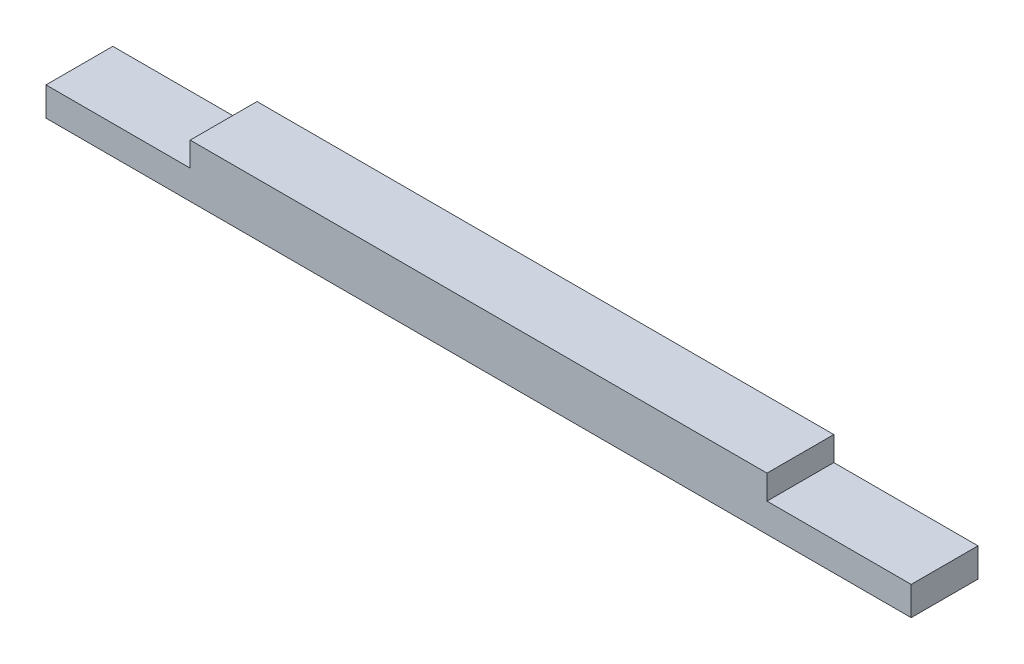
ISO-10303-21;
HEADER;
FILE_DESCRIPTION(('STEP AP214'),'2;1');
FILE_NAME('part.step','',(''),(''),'','','');
FILE_SCHEMA(('AUTOMOTIVE_DESIGN { 1 0 10303 214 1 1 1 1 }'));
ENDSEC;
DATA;
#1=APPLICATION_CONTEXT('core data for automotive mechanical design processes');
#2=APPLICATION_PROTOCOL_DEFINITION('international standard','automotive_design',2000,#1);
#3=PRODUCT_CONTEXT('',#1,'mechanical');
#4=PRODUCT('Part','Part','',(#3));
#5=PRODUCT_RELATED_PRODUCT_CATEGORY('part','',(#4));
#6=PRODUCT_DEFINITION_FORMATION('','',#4);
#7=PRODUCT_DEFINITION_CONTEXT('part definition',#1,'design');
#8=PRODUCT_DEFINITION('design','',#6,#7);
#9=PRODUCT_DEFINITION_SHAPE('','',#8);
#10=(LENGTH_UNIT() NAMED_UNIT(*) SI_UNIT(.MILLI.,.METRE.));
#11=(NAMED_UNIT(*) PLANE_ANGLE_UNIT() SI_UNIT($,.RADIAN.));
#12=(NAMED_UNIT(*) SI_UNIT($,.STERADIAN.) SOLID_ANGLE_UNIT());
#13=UNCERTAINTY_MEASURE_WITH_UNIT(LENGTH_MEASURE(1.E-05),#10,'distance_accuracy_value','');
#14=(GEOMETRIC_REPRESENTATION_CONTEXT(3) GLOBAL_UNCERTAINTY_ASSIGNED_CONTEXT((#13)) GLOBAL_UNIT_ASSIGNED_CONTEXT((#10,
#11,#12)) REPRESENTATION_CONTEXT('',''));
#15=CARTESIAN_POINT('',(0.,0.,0.));
#16=DIRECTION('',(0.,0.,1.));
#17=DIRECTION('',(1.,0.,0.));
#18=AXIS2_PLACEMENT_3D('',#15,#16,#17);
#19=CARTESIAN_POINT('',(7.5,3.,6.95));
#20=DIRECTION('',(-1.,0.,0.));
#21=DIRECTION('',(0.,-1.,0.));
#22=AXIS2_PLACEMENT_3D('',#19,#20,#21);
#23=PLANE('',#22);
#24=DIRECTION('',(0.,1.,0.));
#25=VECTOR('',#24,1.);
#26=CARTESIAN_POINT('',(7.5,3.,0.));
#27=LINE('',#26,#25);
#28=CARTESIAN_POINT('',(7.5,3.,0.));
#29=VERTEX_POINT('',#28);
#30=CARTESIAN_POINT('',(7.49999999999999,5.525,0.));
#31=VERTEX_POINT('',#30);
#32=EDGE_CURVE('E130',#29,#31,#27,.T.);
#33=ORIENTED_EDGE('',*,*,#32,.F.);
#34=DIRECTION('',(0.,0.,-1.));
#35=VECTOR('',#34,1.);
#36=CARTESIAN_POINT('',(7.5,3.,6.95));
#37=LINE('',#36,#35);
#38=CARTESIAN_POINT('',(7.5,3.,6.95));
#39=VERTEX_POINT('',#38);
#40=EDGE_CURVE('E11',#39,#29,#37,.T.);
#41=ORIENTED_EDGE('',*,*,#40,.F.);
#42=DIRECTION('',(0.,1.,0.));
#43=VECTOR('',#42,1.);
#44=CARTESIAN_POINT('',(7.5,3.,6.95));
#45=LINE('',#44,#43);
#46=CARTESIAN_POINT('',(7.49999999999999,5.525,6.95));
#47=VERTEX_POINT('',#46);
#48=EDGE_CURVE('E149',#39,#47,#45,.T.);
#49=ORIENTED_EDGE('',*,*,#48,.T.);
#50=DIRECTION('',(0.,0.,-1.));
#51=VECTOR('',#50,1.);
#52=CARTESIAN_POINT('',(7.49999999999999,5.525,6.95));
#53=LINE('',#52,#51);
#54=EDGE_CURVE('E38',#47,#31,#53,.T.);
#55=ORIENTED_EDGE('',*,*,#54,.T.);
#56=EDGE_LOOP('',(#33,#41,#49,#55));
#57=FACE_BOUND('',#56,.T.);
#58=ADVANCED_FACE('F35',(#57),#23,.T.);
#59=CARTESIAN_POINT('',(7.5,3.,6.95));
#60=DIRECTION('',(0.,-1.,0.));
#61=DIRECTION('',(1.,0.,0.));
#62=AXIS2_PLACEMENT_3D('',#59,#60,#61);
#63=PLANE('',#62);
#64=DIRECTION('',(-1.,0.,0.));
#65=VECTOR('',#64,1.);
#66=CARTESIAN_POINT('',(7.5,3.,0.));
#67=LINE('',#66,#65);
#68=CARTESIAN_POINT('',(-7.5,3.,0.));
#69=VERTEX_POINT('',#68);
#70=EDGE_CURVE('E148',#29,#69,#67,.T.);
#71=ORIENTED_EDGE('',*,*,#70,.T.);
#72=DIRECTION('',(0.,0.,-1.));
#73=VECTOR('',#72,1.);
#74=CARTESIAN_POINT('',(-7.5,3.,6.95));
#75=LINE('',#74,#73);
#76=CARTESIAN_POINT('',(-7.5,3.,6.95));
#77=VERTEX_POINT('',#76);
#78=EDGE_CURVE('E44',#77,#69,#75,.T.);
#79=ORIENTED_EDGE('',*,*,#78,.F.);
#80=DIRECTION('',(-1.,0.,0.));
#81=VECTOR('',#80,1.);
#82=CARTESIAN_POINT('',(7.5,3.,6.95));
#83=LINE('',#82,#81);
#84=EDGE_CURVE('E125',#39,#77,#83,.T.);
#85=ORIENTED_EDGE('',*,*,#84,.F.);
#86=ORIENTED_EDGE('',*,*,#40,.T.);
#87=EDGE_LOOP('',(#71,#79,#85,#86));
#88=FACE_BOUND('',#87,.T.);
#89=ADVANCED_FACE('F162',(#88),#63,.F.);
#90=CARTESIAN_POINT('',(-7.5,0.,6.95));
#91=DIRECTION('',(-1.,0.,0.));
#92=DIRECTION('',(0.,-1.,0.));
#93=AXIS2_PLACEMENT_3D('',#90,#91,#92);
#94=PLANE('',#93);
#95=DIRECTION('',(0.,1.,0.));
#96=VECTOR('',#95,1.);
#97=CARTESIAN_POINT('',(-7.5,0.,0.));
#98=LINE('',#97,#96);
#99=CARTESIAN_POINT('',(-7.5,0.,0.));
#100=VERTEX_POINT('',#99);
#101=EDGE_CURVE('E110',#100,#69,#98,.T.);
#102=ORIENTED_EDGE('',*,*,#101,.F.);
#103=DIRECTION('',(0.,0.,-1.));
#104=VECTOR('',#103,1.);
#105=CARTESIAN_POINT('',(-7.5,0.,6.95));
#106=LINE('',#105,#104);
#107=CARTESIAN_POINT('',(-7.5,0.,6.95));
#108=VERTEX_POINT('',#107);
#109=EDGE_CURVE('E104',#108,#100,#106,.T.);
#110=ORIENTED_EDGE('',*,*,#109,.F.);
#111=DIRECTION('',(0.,1.,0.));
#112=VECTOR('',#111,1.);
#113=CARTESIAN_POINT('',(-7.5,0.,6.95));
#114=LINE('',#113,#112);
#115=EDGE_CURVE('E108',#108,#77,#114,.T.);
#116=ORIENTED_EDGE('',*,*,#115,.T.);
#117=ORIENTED_EDGE('',*,*,#78,.T.);
#118=EDGE_LOOP('',(#102,#110,#116,#117));
#119=FACE_BOUND('',#118,.T.);
#120=ADVANCED_FACE('F106',(#119),#94,.T.);
#121=CARTESIAN_POINT('',(-7.5,0.,6.95));
#122=DIRECTION('',(0.,1.,0.));
#123=DIRECTION('',(0.,0.,1.));
#124=AXIS2_PLACEMENT_3D('',#121,#122,#123);
#125=PLANE('',#124);
#126=DIRECTION('',(1.,0.,0.));
#127=VECTOR('',#126,1.);
#128=CARTESIAN_POINT('',(-7.5,0.,0.));
#129=LINE('',#128,#127);
#130=CARTESIAN_POINT('',(82.5,0.,0.));
#131=VERTEX_POINT('',#130);
#132=EDGE_CURVE('E145',#100,#131,#129,.T.);
#133=ORIENTED_EDGE('',*,*,#132,.T.);
#134=DIRECTION('',(0.,0.,-1.));
#135=VECTOR('',#134,1.);
#136=CARTESIAN_POINT('',(82.5,0.,6.95));
#137=LINE('',#136,#135);
#138=CARTESIAN_POINT('',(82.5,0.,6.95));
#139=VERTEX_POINT('',#138);
#140=EDGE_CURVE('E113',#139,#131,#137,.T.);
#141=ORIENTED_EDGE('',*,*,#140,.F.);
#142=DIRECTION('',(1.,0.,0.));
#143=VECTOR('',#142,1.);
#144=CARTESIAN_POINT('',(-7.5,0.,6.95));
#145=LINE('',#144,#143);
#146=EDGE_CURVE('E116',#108,#139,#145,.T.);
#147=ORIENTED_EDGE('',*,*,#146,.F.);
#148=ORIENTED_EDGE('',*,*,#109,.T.);
#149=EDGE_LOOP('',(#133,#141,#147,#148));
#150=FACE_BOUND('',#149,.T.);
#151=ADVANCED_FACE('F117',(#150),#125,.F.);
#152=CARTESIAN_POINT('',(82.5,0.,6.95));
#153=DIRECTION('',(-1.,0.,0.));
#154=DIRECTION('',(0.,0.,1.));
#155=AXIS2_PLACEMENT_3D('',#152,#153,#154);
#156=PLANE('',#155);
#157=DIRECTION('',(0.,1.,0.));
#158=VECTOR('',#157,1.);
#159=CARTESIAN_POINT('',(82.5,0.,0.));
#160=LINE('',#159,#158);
#161=CARTESIAN_POINT('',(82.5,3.,0.));
#162=VERTEX_POINT('',#161);
#163=EDGE_CURVE('E142',#131,#162,#160,.T.);
#164=ORIENTED_EDGE('',*,*,#163,.T.);
#165=DIRECTION('',(0.,0.,-1.));
#166=VECTOR('',#165,1.);
#167=CARTESIAN_POINT('',(82.5,3.,6.95));
#168=LINE('',#167,#166);
#169=CARTESIAN_POINT('',(82.5,3.,6.95));
#170=VERTEX_POINT('',#169);
#171=EDGE_CURVE('E153',#170,#162,#168,.T.);
#172=ORIENTED_EDGE('',*,*,#171,.F.);
#173=DIRECTION('',(0.,1.,0.));
#174=VECTOR('',#173,1.);
#175=CARTESIAN_POINT('',(82.5,0.,6.95));
#176=LINE('',#175,#174);
#177=EDGE_CURVE('E121',#139,#170,#176,.T.);
#178=ORIENTED_EDGE('',*,*,#177,.F.);
#179=ORIENTED_EDGE('',*,*,#140,.T.);
#180=EDGE_LOOP('',(#164,#172,#178,#179));
#181=FACE_BOUND('',#180,.T.);
#182=ADVANCED_FACE('F174',(#181),#156,.F.);
#183=CARTESIAN_POINT('',(67.5,3.,6.95));
#184=DIRECTION('',(0.,1.,0.));
#185=DIRECTION('',(0.,0.,1.));
#186=AXIS2_PLACEMENT_3D('',#183,#184,#185);
#187=PLANE('',#186);
#188=DIRECTION('',(1.,0.,0.));
#189=VECTOR('',#188,1.);
#190=CARTESIAN_POINT('',(67.5,3.,0.));
#191=LINE('',#190,#189);
#192=CARTESIAN_POINT('',(67.5,3.,0.));
#193=VERTEX_POINT('',#192);
#194=EDGE_CURVE('E139',#193,#162,#191,.T.);
#195=ORIENTED_EDGE('',*,*,#194,.F.);
#196=DIRECTION('',(0.,0.,-1.));
#197=VECTOR('',#196,1.);
#198=CARTESIAN_POINT('',(67.5,3.,6.95));
#199=LINE('',#198,#197);
#200=CARTESIAN_POINT('',(67.5,3.,6.95));
#201=VERTEX_POINT('',#200);
#202=EDGE_CURVE('E155',#201,#193,#199,.T.);
#203=ORIENTED_EDGE('',*,*,#202,.F.);
#204=DIRECTION('',(1.,0.,0.));
#205=VECTOR('',#204,1.);
#206=CARTESIAN_POINT('',(67.5,3.,6.95));
#207=LINE('',#206,#205);
#208=EDGE_CURVE('E169',#201,#170,#207,.T.);
#209=ORIENTED_EDGE('',*,*,#208,.T.);
#210=ORIENTED_EDGE('',*,*,#171,.T.);
#211=EDGE_LOOP('',(#195,#203,#209,#210));
#212=FACE_BOUND('',#211,.T.);
#213=ADVANCED_FACE('F178',(#212),#187,.T.);
#214=CARTESIAN_POINT('',(67.5,3.,6.95));
#215=DIRECTION('',(-1.,0.,0.));
#216=DIRECTION('',(0.,0.,1.));
#217=AXIS2_PLACEMENT_3D('',#214,#215,#216);
#218=PLANE('',#217);
#219=DIRECTION('',(0.,1.,0.));
#220=VECTOR('',#219,1.);
#221=CARTESIAN_POINT('',(67.5,3.,0.));
#222=LINE('',#221,#220);
#223=CARTESIAN_POINT('',(67.5,5.525,0.));
#224=VERTEX_POINT('',#223);
#225=EDGE_CURVE('E136',#193,#224,#222,.T.);
#226=ORIENTED_EDGE('',*,*,#225,.T.);
#227=DIRECTION('',(0.,0.,-1.));
#228=VECTOR('',#227,1.);
#229=CARTESIAN_POINT('',(67.5,5.525,6.95));
#230=LINE('',#229,#228);
#231=CARTESIAN_POINT('',(67.5,5.525,6.95));
#232=VERTEX_POINT('',#231);
#233=EDGE_CURVE('E156',#232,#224,#230,.T.);
#234=ORIENTED_EDGE('',*,*,#233,.F.);
#235=DIRECTION('',(0.,1.,0.));
#236=VECTOR('',#235,1.);
#237=CARTESIAN_POINT('',(67.5,3.,6.95));
#238=LINE('',#237,#236);
#239=EDGE_CURVE('E165',#201,#232,#238,.T.);
#240=ORIENTED_EDGE('',*,*,#239,.F.);
#241=ORIENTED_EDGE('',*,*,#202,.T.);
#242=EDGE_LOOP('',(#226,#234,#240,#241));
#243=FACE_BOUND('',#242,.T.);
#244=ADVANCED_FACE('F181',(#243),#218,.F.);
#245=CARTESIAN_POINT('',(7.49999999999999,5.525,6.95));
#246=DIRECTION('',(0.,1.,0.));
#247=DIRECTION('',(0.,0.,1.));
#248=AXIS2_PLACEMENT_3D('',#245,#246,#247);
#249=PLANE('',#248);
#250=DIRECTION('',(1.,0.,0.));
#251=VECTOR('',#250,1.);
#252=CARTESIAN_POINT('',(7.49999999999999,5.525,0.));
#253=LINE('',#252,#251);
#254=EDGE_CURVE('E133',#31,#224,#253,.T.);
#255=ORIENTED_EDGE('',*,*,#254,.F.);
#256=ORIENTED_EDGE('',*,*,#54,.F.);
#257=DIRECTION('',(1.,0.,0.));
#258=VECTOR('',#257,1.);
#259=CARTESIAN_POINT('',(7.49999999999999,5.525,6.95));
#260=LINE('',#259,#258);
#261=EDGE_CURVE('E163',#47,#232,#260,.T.);
#262=ORIENTED_EDGE('',*,*,#261,.T.);
#263=ORIENTED_EDGE('',*,*,#233,.T.);
#264=EDGE_LOOP('',(#255,#256,#262,#263));
#265=FACE_BOUND('',#264,.T.);
#266=ADVANCED_FACE('F158',(#265),#249,.T.);
#267=CARTESIAN_POINT('',(0.,0.,6.95));
#268=DIRECTION('',(0.,0.,-1.));
#269=DIRECTION('',(-1.,0.,0.));
#270=AXIS2_PLACEMENT_3D('',#267,#268,#269);
#271=PLANE('',#270);
#272=ORIENTED_EDGE('',*,*,#48,.F.);
#273=ORIENTED_EDGE('',*,*,#84,.T.);
#274=ORIENTED_EDGE('',*,*,#115,.F.);
#275=ORIENTED_EDGE('',*,*,#146,.T.);
#276=ORIENTED_EDGE('',*,*,#177,.T.);
#277=ORIENTED_EDGE('',*,*,#208,.F.);
#278=ORIENTED_EDGE('',*,*,#239,.T.);
#279=ORIENTED_EDGE('',*,*,#261,.F.);
#280=EDGE_LOOP('',(#272,#273,#274,#275,#276,#277,#278,#279));
#281=FACE_BOUND('',#280,.T.);
#282=ADVANCED_FACE('F124',(#281),#271,.F.);
#283=CARTESIAN_POINT('',(0.,0.,0.));
#284=DIRECTION('',(0.,0.,-1.));
#285=DIRECTION('',(-1.,0.,0.));
#286=AXIS2_PLACEMENT_3D('',#283,#284,#285);
#287=PLANE('',#286);
#288=ORIENTED_EDGE('',*,*,#32,.T.);
#289=ORIENTED_EDGE('',*,*,#254,.T.);
#290=ORIENTED_EDGE('',*,*,#225,.F.);
#291=ORIENTED_EDGE('',*,*,#194,.T.);
#292=ORIENTED_EDGE('',*,*,#163,.F.);
#293=ORIENTED_EDGE('',*,*,#132,.F.);
#294=ORIENTED_EDGE('',*,*,#101,.T.);
#295=ORIENTED_EDGE('',*,*,#70,.F.);
#296=EDGE_LOOP('',(#288,#289,#290,#291,#292,#293,#294,#295));
#297=FACE_BOUND('',#296,.T.);
#298=ADVANCED_FACE('F161',(#297),#287,.T.);
#299=CLOSED_SHELL('',(#58,#89,#120,#151,#182,#213,#244,#266,#282,#298));
#300=MANIFOLD_SOLID_BREP('B2',#299);
#301=ADVANCED_BREP_SHAPE_REPRESENTATION('',(#18,#300),#14);
#302=SHAPE_DEFINITION_REPRESENTATION(#9,#301);
ENDSEC;
END-ISO-10303-21;
